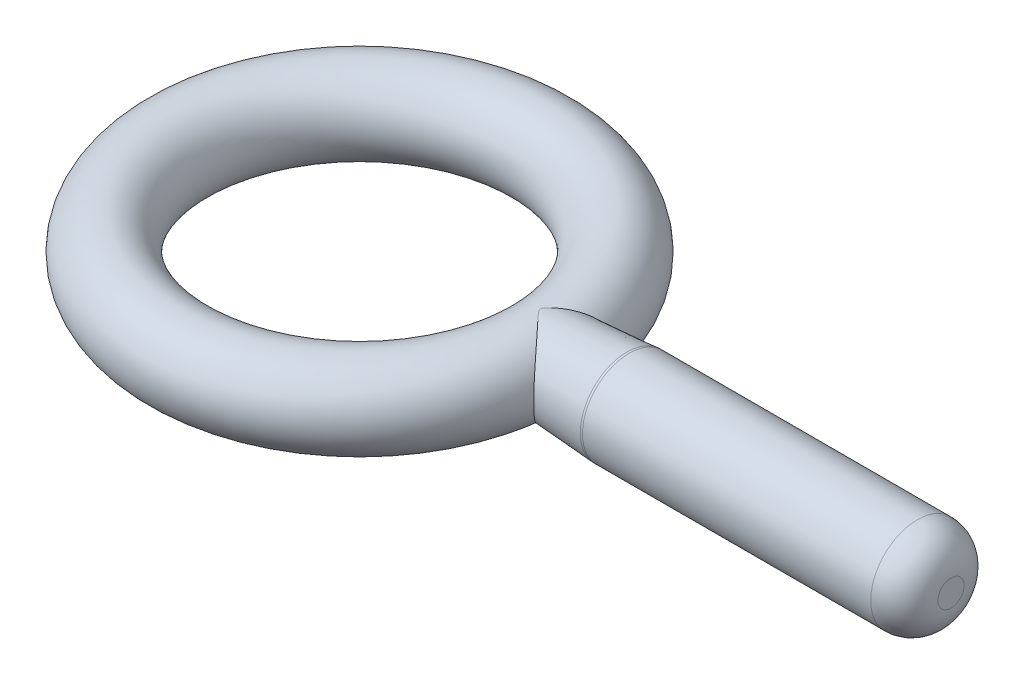
ISO-10303-21;
HEADER;
FILE_DESCRIPTION(('STEP AP214'),'2;1');
FILE_NAME('part.step','',(''),(''),'','','');
FILE_SCHEMA(('AUTOMOTIVE_DESIGN { 1 0 10303 214 1 1 1 1 }'));
ENDSEC;
DATA;
#1=APPLICATION_CONTEXT('core data for automotive mechanical design processes');
#2=APPLICATION_PROTOCOL_DEFINITION('international standard','automotive_design',2000,#1);
#3=PRODUCT_CONTEXT('',#1,'mechanical');
#4=PRODUCT('Part','Part','',(#3));
#5=PRODUCT_RELATED_PRODUCT_CATEGORY('part','',(#4));
#6=PRODUCT_DEFINITION_FORMATION('','',#4);
#7=PRODUCT_DEFINITION_CONTEXT('part definition',#1,'design');
#8=PRODUCT_DEFINITION('design','',#6,#7);
#9=PRODUCT_DEFINITION_SHAPE('','',#8);
#10=(LENGTH_UNIT() NAMED_UNIT(*) SI_UNIT(.MILLI.,.METRE.));
#11=(NAMED_UNIT(*) PLANE_ANGLE_UNIT() SI_UNIT($,.RADIAN.));
#12=(NAMED_UNIT(*) SI_UNIT($,.STERADIAN.) SOLID_ANGLE_UNIT());
#13=UNCERTAINTY_MEASURE_WITH_UNIT(LENGTH_MEASURE(1.E-05),#10,'distance_accuracy_value','');
#14=(GEOMETRIC_REPRESENTATION_CONTEXT(3) GLOBAL_UNCERTAINTY_ASSIGNED_CONTEXT((#13)) GLOBAL_UNIT_ASSIGNED_CONTEXT((#10,
#11,#12)) REPRESENTATION_CONTEXT('',''));
#15=CARTESIAN_POINT('',(0.,0.,0.));
#16=DIRECTION('',(0.,0.,1.));
#17=DIRECTION('',(1.,0.,0.));
#18=AXIS2_PLACEMENT_3D('',#15,#16,#17);
#19=CARTESIAN_POINT('',(12.303125,0.,0.));
#20=DIRECTION('',(1.,0.,0.));
#21=DIRECTION('',(0.,0.,-1.));
#22=AXIS2_PLACEMENT_3D('',#19,#20,#21);
#23=CONICAL_SURFACE('',#22,2.778125,0.0665681637758238);
#24=CARTESIAN_POINT('',(18.1803030629031,0.,0.));
#25=DIRECTION('',(1.,0.,0.));
#26=DIRECTION('',(0.,0.,-1.));
#27=AXIS2_PLACEMENT_3D('',#24,#25,#26);
#28=CIRCLE('',#27,3.16993687086021);
#29=CARTESIAN_POINT('',(18.1803030629031,0.,-3.16993687086021));
#30=VERTEX_POINT('',#29);
#31=EDGE_CURVE('E12',#30,#30,#28,.F.);
#32=ORIENTED_EDGE('',*,*,#31,.T.);
#33=EDGE_LOOP('',(#32));
#34=FACE_BOUND('',#33,.T.);
#35=CARTESIAN_POINT('',(13.5832562363198,-2.41892800698247,-1.53239388838063));
#36=CARTESIAN_POINT('',(13.5135763404157,-2.46299187141445,-1.454156337449));
#37=CARTESIAN_POINT('',(13.4424420313556,-2.50266443957038,-1.37480836019574));
#38=CARTESIAN_POINT('',(13.2977882894049,-2.57361403576594,-1.21449156348259));
#39=CARTESIAN_POINT('',(13.2242681293977,-2.60488847692526,-1.13352225283643));
#40=CARTESIAN_POINT('',(13.0755241207558,-2.65934375039045,-0.970557764191281));
#41=CARTESIAN_POINT('',(13.0003012922684,-2.68252929923189,-0.888563212988189));
#42=CARTESIAN_POINT('',(12.8487958872274,-2.72115906979434,-0.723787206985432));
#43=CARTESIAN_POINT('',(12.7725137635382,-2.73660650095508,-0.641006092958863));
#44=CARTESIAN_POINT('',(12.6382156719464,-2.75736359266297,-0.493655434518413));
#45=CARTESIAN_POINT('',(12.5801087417439,-2.76420071822641,-0.429364697840586));
#46=CARTESIAN_POINT('',(12.480809296198,-2.77252083795878,-0.315377186730975));
#47=CARTESIAN_POINT('',(12.4391356694152,-2.77493216510209,-0.266215889112578));
#48=CARTESIAN_POINT('',(12.3849505191755,-2.77692395441636,-0.193513552212571));
#49=CARTESIAN_POINT('',(12.3697652078103,-2.77733522186198,-0.172010467549974));
#50=CARTESIAN_POINT('',(12.3418985052292,-2.77788002476633,-0.127390571839503));
#51=CARTESIAN_POINT('',(12.329205758339,-2.77801484751535,-0.10428176089174));
#52=CARTESIAN_POINT('',(12.3150444125036,-2.77810293824316,-0.0683353648952874));
#53=CARTESIAN_POINT('',(12.3111841210951,-2.77811440983813,-0.0564916080212249));
#54=CARTESIAN_POINT('',(12.3055658094955,-2.77812536371549,-0.0323500451613437));
#55=CARTESIAN_POINT('',(12.3037964886106,-2.7781249107569,-0.0200550536427031));
#56=CARTESIAN_POINT('',(12.302769620849,-2.77812508041926,0.00474864103902631));
#57=CARTESIAN_POINT('',(12.303532592562,-2.77812571180647,0.0172582689126638));
#58=CARTESIAN_POINT('',(12.3074156043813,-2.77812224103337,0.0419315689195286));
#59=CARTESIAN_POINT('',(12.3105457746195,-2.77811811848928,0.054093520433139));
#60=CARTESIAN_POINT('',(12.322376233577,-2.77806685757164,0.0895230701968081));
#61=CARTESIAN_POINT('',(12.3335256106738,-2.77798131875711,0.111918971692619));
#62=CARTESIAN_POINT('',(12.3586388336365,-2.77758190167001,0.155124996468936));
#63=CARTESIAN_POINT('',(12.3726278044967,-2.77726591465277,0.17591850043688));
#64=CARTESIAN_POINT('',(12.4193053057537,-2.77578961285454,0.240982687643902));
#65=CARTESIAN_POINT('',(12.4543251221487,-2.77407133604826,0.283547207105764));
#66=CARTESIAN_POINT('',(12.5257593798125,-2.76900992220618,0.367401563492745));
#67=CARTESIAN_POINT('',(12.5621764513328,-2.7656635667131,0.408688702566214));
#68=CARTESIAN_POINT('',(12.6354313975813,-2.75728693873451,0.490524075367687));
#69=CARTESIAN_POINT('',(12.6722677248083,-2.75226163398615,0.531074121139215));
#70=CARTESIAN_POINT('',(12.7459830904647,-2.74047930289668,0.611816408555615));
#71=CARTESIAN_POINT('',(12.7828620783257,-2.73372353904634,0.652008889042246));
#72=CARTESIAN_POINT('',(12.893844442824,-2.71068452350345,0.772831686983826));
#73=CARTESIAN_POINT('',(12.9677681593476,-2.69168735539186,0.85313326707215));
#74=CARTESIAN_POINT('',(13.1142621446455,-2.64617423293009,1.01291459942908));
#75=CARTESIAN_POINT('',(13.1868316796166,-2.6196543214266,1.09239389628885));
#76=CARTESIAN_POINT('',(13.3301144796223,-2.55874585148866,1.25021548707028));
#77=CARTESIAN_POINT('',(13.4008254451987,-2.52434801412791,1.32855632342553));
#78=CARTESIAN_POINT('',(13.5397124249339,-2.44740530473701,1.48340359825539));
#79=CARTESIAN_POINT('',(13.6078891727174,-2.4048628127658,1.55991056529854));
#80=CARTESIAN_POINT('',(13.7847550444937,-2.28069763617699,1.75965966157935));
#81=CARTESIAN_POINT('',(13.8908161703866,-2.1916999602104,1.88078409739794));
#82=CARTESIAN_POINT('',(14.0912184705149,-1.98947051861761,2.11186790539339));
#83=CARTESIAN_POINT('',(14.1855786489424,-1.87627888451444,2.2218453275785));
#84=CARTESIAN_POINT('',(14.3420352486407,-1.64967598402203,2.40567340274227));
#85=CARTESIAN_POINT('',(14.4068470211175,-1.54048831044554,2.48240496445262));
#86=CARTESIAN_POINT('',(14.5237837236655,-1.30696059600801,2.62158431251988));
#87=CARTESIAN_POINT('',(14.5759119770374,-1.18262453712665,2.68403584023323));
#88=CARTESIAN_POINT('',(14.6426826916325,-0.98614746904953,2.76433051612444));
#89=CARTESIAN_POINT('',(14.6631067960478,-0.918640868149908,2.78895128697761));
#90=CARTESIAN_POINT('',(14.6997018386652,-0.780890732356137,2.83313715859281));
#91=CARTESIAN_POINT('',(14.7158750380578,-0.710648675462262,2.85270494709799));
#92=CARTESIAN_POINT('',(14.7436754986556,-0.568021835797054,2.88637942121642));
#93=CARTESIAN_POINT('',(14.7553051876286,-0.495638219645752,2.90048902330318));
#94=CARTESIAN_POINT('',(14.7738118728375,-0.349413979882284,2.92295791779403));
#95=CARTESIAN_POINT('',(14.7806896777846,-0.275573606393201,2.93131818866117));
#96=CARTESIAN_POINT('',(14.7926983923845,-0.0741111112037358,2.94591608379945));
#97=CARTESIAN_POINT('',(14.7930821496996,0.0542962569364278,2.94638389495357));
#98=CARTESIAN_POINT('',(14.7793776333571,0.309074126188862,2.92972231239334));
#99=CARTESIAN_POINT('',(14.7652927649152,0.435445099462197,2.91259705923681));
#100=CARTESIAN_POINT('',(14.7245166028211,0.676536390195432,2.86315801523773));
#101=CARTESIAN_POINT('',(14.698461441812,0.791524828274756,2.83161100961142));
#102=CARTESIAN_POINT('',(14.6352584560274,1.01378208262174,2.75537181400266));
#103=CARTESIAN_POINT('',(14.5981086368988,1.12104950666979,2.71067726066564));
#104=CARTESIAN_POINT('',(14.5104904123354,1.3351835952853,2.60576120301901));
#105=CARTESIAN_POINT('',(14.4591377397979,1.44118454237248,2.54451953236495));
#106=CARTESIAN_POINT('',(14.3469826623688,1.64082163164687,2.4115828890057));
#107=CARTESIAN_POINT('',(14.2861753765981,1.73445134082488,2.33988251825778));
#108=CARTESIAN_POINT('',(14.1261644511506,1.9502847213945,2.15251769719254));
#109=CARTESIAN_POINT('',(14.0224036336765,2.06505637023745,2.0320996200686));
#110=CARTESIAN_POINT('',(13.8577102155062,2.21672050075151,1.84317083973067));
#111=CARTESIAN_POINT('',(13.8011895201492,2.26392860847356,1.7786825897361));
#112=CARTESIAN_POINT('',(13.6855550006826,2.35169563792362,1.64750624032136));
#113=CARTESIAN_POINT('',(13.6264411977877,2.3922546140365,1.5808181588995));
#114=CARTESIAN_POINT('',(13.4868623559348,2.47880309872441,1.42427115430598));
#115=CARTESIAN_POINT('',(13.4055984320405,2.52240177532326,1.33380304667384));
#116=CARTESIAN_POINT('',(13.240181592405,2.59885928936615,1.15095820454916));
#117=CARTESIAN_POINT('',(13.156027391867,2.63171328043576,1.05858062871152));
#118=CARTESIAN_POINT('',(12.9860843370933,2.68703236595625,0.873040531442785));
#119=CARTESIAN_POINT('',(12.9003046069067,2.70954381485635,0.779883456173959));
#120=CARTESIAN_POINT('',(12.7711915931537,2.7360360336676,0.639294779817519));
#121=CARTESIAN_POINT('',(12.7280892429111,2.743653432824,0.592299806893884));
#122=CARTESIAN_POINT('',(12.6420631152261,2.75653322903348,0.497827991246356));
#123=CARTESIAN_POINT('',(12.599139303027,2.76179610796832,0.450351249158526));
#124=CARTESIAN_POINT('',(12.5338814035776,2.76815294418585,0.376421469757899));
#125=CARTESIAN_POINT('',(12.5111721164537,2.77005050145913,0.350359660869038));
#126=CARTESIAN_POINT('',(12.46621403036,2.77322178066244,0.297412452836114));
#127=CARTESIAN_POINT('',(12.443970233238,2.77449049846654,0.270522200794253));
#128=CARTESIAN_POINT('',(12.4006771755804,2.77643682337206,0.215261388670495));
#129=CARTESIAN_POINT('',(12.3796487304276,2.77710599877242,0.186875482775861));
#130=CARTESIAN_POINT('',(12.3415318925602,2.77791354882009,0.127568780684565));
#131=CARTESIAN_POINT('',(12.3243880754633,2.77805989800002,0.0966934793937997));
#132=CARTESIAN_POINT('',(12.3102339039632,2.77811862817759,0.0527429028812321));
#133=CARTESIAN_POINT('',(12.3074442191345,2.77812225257461,0.0417170359620835));
#134=CARTESIAN_POINT('',(12.303808458778,2.77812542686532,0.0193734645310327));
#135=CARTESIAN_POINT('',(12.30295548007,2.7781249912589,0.00805694241242065));
#136=CARTESIAN_POINT('',(12.3033516068684,2.77812500846097,-0.0145604360803995));
#137=CARTESIAN_POINT('',(12.3046050506421,2.77812546310328,-0.0258612120315243));
#138=CARTESIAN_POINT('',(12.3089587045027,2.77811957586103,-0.0481228717730149));
#139=CARTESIAN_POINT('',(12.3120657870316,2.77811320861375,-0.0590823302059561));
#140=CARTESIAN_POINT('',(12.3245900036945,2.7780527455894,-0.0947731412672496));
#141=CARTESIAN_POINT('',(12.3369026221282,2.77794642183314,-0.118428901946786));
#142=CARTESIAN_POINT('',(12.3643947253272,2.7774627069956,-0.164056292451032));
#143=CARTESIAN_POINT('',(12.3796001910989,2.77708276498063,-0.186009903889161));
#144=CARTESIAN_POINT('',(12.4305362958139,2.77531321249915,-0.255290402017948));
#145=CARTESIAN_POINT('',(12.468643887137,2.7732571547071,-0.300842612443467));
#146=CARTESIAN_POINT('',(12.5461639229476,2.76723867653559,-0.390702758878024));
#147=CARTESIAN_POINT('',(12.5855786440754,2.76327274770117,-0.435008245467699));
#148=CARTESIAN_POINT('',(12.664742612495,2.75337121599071,-0.522878266046132));
#149=CARTESIAN_POINT('',(12.7044904472217,2.74744174604524,-0.566444668598899));
#150=CARTESIAN_POINT('',(12.783951437568,2.73355659637391,-0.653222227542304));
#151=CARTESIAN_POINT('',(12.8236645994177,2.72560217403282,-0.696433587269082));
#152=CARTESIAN_POINT('',(12.9433402642349,2.69843038542798,-0.826628994173566));
#153=CARTESIAN_POINT('',(13.022995878258,2.67600591544378,-0.913256572589387));
#154=CARTESIAN_POINT('',(13.1805256101198,2.62226585311935,-1.08546334000162));
#155=CARTESIAN_POINT('',(13.2583986773793,2.59094515635314,-1.17104189760477));
#156=CARTESIAN_POINT('',(13.4117244830532,2.5189772291064,-1.34063577846342));
#157=CARTESIAN_POINT('',(13.4871747599538,2.47832083541126,-1.42464947760026));
#158=CARTESIAN_POINT('',(13.6348160382779,2.38733030435372,-1.59018490767675));
#159=CARTESIAN_POINT('',(13.7070084755644,2.33700048293585,-1.67170773122832));
#160=CARTESIAN_POINT('',(13.8806403906818,2.20004766949008,-1.86911691805444));
#161=CARTESIAN_POINT('',(13.9797757724695,2.10751431089851,-1.98303310289109));
#162=CARTESIAN_POINT('',(14.1662160286214,1.89984391945694,-2.19919607352727));
#163=CARTESIAN_POINT('',(14.2535416989775,1.78474751781482,-2.30146332074967));
#164=CARTESIAN_POINT('',(14.3982282258451,1.55517293006451,-2.47215679210914));
#165=CARTESIAN_POINT('',(14.458150697959,1.44438099540678,-2.5433556940723));
#166=CARTESIAN_POINT('',(14.5652230177635,1.20882700438826,-2.67118832950388));
#167=CARTESIAN_POINT('',(14.6123762310159,1.0840686414009,-2.72782590066652));
#168=CARTESIAN_POINT('',(14.6717551651694,0.88807444043183,-2.79938150044837));
#169=CARTESIAN_POINT('',(14.6897108151404,0.820946368732102,-2.82106641103707));
#170=CARTESIAN_POINT('',(14.7214515302592,0.684334192613849,-2.85945235351029));
#171=CARTESIAN_POINT('',(14.73523872544,0.614851311731245,-2.87615593073982));
#172=CARTESIAN_POINT('',(14.7583962068525,0.474120715002649,-2.90423800240995));
#173=CARTESIAN_POINT('',(14.7677683513804,0.402873754972846,-2.9156187372221));
#174=CARTESIAN_POINT('',(14.7819340741979,0.259288861976566,-2.93282901960283));
#175=CARTESIAN_POINT('',(14.7867283185962,0.186951089285483,-2.9386593747805));
#176=CARTESIAN_POINT('',(14.7934298592709,-0.0114980591261309,-2.9468074424078));
#177=CARTESIAN_POINT('',(14.790630946451,-0.138084336049694,-2.94340055333663));
#178=CARTESIAN_POINT('',(14.7710618947868,-0.388444182302427,-2.91961732372674));
#179=CARTESIAN_POINT('',(14.7542940585165,-0.512218211735797,-2.89924377989483));
#180=CARTESIAN_POINT('',(14.7084925114709,-0.749740819465111,-2.84376057301279));
#181=CARTESIAN_POINT('',(14.6798622051001,-0.863682450042134,-2.80913578410208));
#182=CARTESIAN_POINT('',(14.611735319671,-1.08335336560222,-2.72707174562202));
#183=CARTESIAN_POINT('',(14.5722362672631,-1.1890807742823,-2.67962957930705));
#184=CARTESIAN_POINT('',(14.4794637796763,-1.40084916366243,-2.5687487586293));
#185=CARTESIAN_POINT('',(14.4252084127187,-1.50586605528883,-2.50418544876772));
#186=CARTESIAN_POINT('',(14.3073594881813,-1.70303708322481,-2.36484339849982));
#187=CARTESIAN_POINT('',(14.2437607313929,-1.79518400187566,-2.29005897209158));
#188=CARTESIAN_POINT('',(14.0883561871039,-1.99251124038921,-2.10863228869027));
#189=CARTESIAN_POINT('',(13.9938736659211,-2.09305359842948,-1.99924338090606));
#190=CARTESIAN_POINT('',(13.7951801848466,-2.27222459239035,-1.77159352507759));
#191=CARTESIAN_POINT('',(13.6909554839058,-2.35082163306389,-1.65332009326328));
#192=CARTESIAN_POINT('',(13.5832562363198,-2.41892800698247,-1.53239388838063));
#193=B_SPLINE_CURVE_WITH_KNOTS('',3,(#35,#36,#37,#38,#39,#40,#41,#42,#43,#44,#45,#46,#47,#48,
#49,#50,#51,#52,#53,#54,#55,#56,#57,#58,#59,#60,#61,#62,#63,#64,#65,#66,#67,#68,#69,#70,#71,#72,
#73,#74,#75,#76,#77,#78,#79,#80,#81,#82,#83,#84,#85,#86,#87,#88,#89,#90,#91,#92,#93,#94,#95,#96,
#97,#98,#99,#100,#101,#102,#103,#104,#105,#106,#107,#108,#109,#110,#111,#112,#113,#114,#115,
#116,#117,#118,#119,#120,#121,#122,#123,#124,#125,#126,#127,#128,#129,#130,#131,#132,#133,#134,
#135,#136,#137,#138,#139,#140,#141,#142,#143,#144,#145,#146,#147,#148,#149,#150,#151,#152,#153,
#154,#155,#156,#157,#158,#159,#160,#161,#162,#163,#164,#165,#166,#167,#168,#169,#170,#171,#172,
#173,#174,#175,#176,#177,#178,#179,#180,#181,#182,#183,#184,#185,#186,#187,#188,#189,#190,#191,
#192),.UNSPECIFIED.,.T.,.F.,(4,2,2,2,2,2,2,2,2,2,2,2,2,2,2,2,2,2,2,2,2,2,2,2,2,2,2,2,2,2,2,2,2,
2,2,2,2,2,2,2,2,2,2,2,2,2,2,2,2,2,2,2,2,2,2,2,2,2,2,2,2,2,2,2,2,2,2,2,2,2,2,2,2,2,2,2,2,2,4),
(0.,0.340808897711042,0.681722654890222,1.0224372958267,1.36301050567915,1.62376448341974,
1.81694659657962,1.89590803296743,1.97450093532228,2.01173807988941,2.04877304155535,
2.08610881932403,2.12360528143749,2.19806761676638,2.27322001712892,2.43837333009324,
2.60385446014656,2.76885023194437,2.93372596897385,3.26581362346504,3.59807628943562,
3.93073233845873,4.26329132556055,4.81308943765323,5.36198255765062,5.80537860270484,
6.24865834493283,6.47248013713595,6.69618262940972,6.9197654250497,7.1433101603185,
7.52634196242297,7.90928363798432,8.27388327403752,8.63854848926413,9.03529992526974,
9.43225686572274,10.0169732843249,10.3104307999294,10.603885915154,10.9908936227794,
11.3780756496787,11.7635050103942,11.9561376813369,12.1487309095593,12.2525949770742,
12.3572728021163,12.46340065727,12.567902691468,12.6018795654945,12.6357351412085,
12.6696605294179,12.7037124859647,12.7830668808238,12.8631708333141,13.0411557028535,
13.219468787144,13.3972300997664,13.5748813004274,13.9339267200644,14.2931785683286,
14.6527845498171,15.0122304586071,15.5415690479142,16.0699630259487,16.5023646664321,
16.9346522287207,17.1527568856173,17.3707499044164,17.5886510877247,17.8065205604298,
18.184399748628,18.5622166612517,18.9281212394471,19.2941091537879,19.6966637331297,
20.099443171854,20.6254537372019,21.1522177539648),.UNSPECIFIED.);
#194=CARTESIAN_POINT('',(12.303125,-2.77812500027151,0.000544581015488757));
#195=VERTEX_POINT('',#194);
#196=CARTESIAN_POINT('',(12.303125,2.778125,0.));
#197=VERTEX_POINT('',#196);
#198=EDGE_CURVE('E65',#195,#197,#193,.T.);
#199=ORIENTED_EDGE('',*,*,#198,.F.);
#200=CARTESIAN_POINT('',(12.303125,-2.778125,0.));
#201=CARTESIAN_POINT('',(12.3031250338619,-2.778125,2.26908751278166E-05));
#202=CARTESIAN_POINT('',(12.3031250676611,-2.778125,4.53817503430946E-05));
#203=CARTESIAN_POINT('',(12.3031251351338,-2.778125,9.07635011485793E-05));
#204=CARTESIAN_POINT('',(12.3031251688073,-2.77812499999999,0.000113454376738786));
#205=CARTESIAN_POINT('',(12.303125236029,-2.77812499999999,0.000158836128290702));
#206=CARTESIAN_POINT('',(12.303125269577,-2.77812499999999,0.00018152700425241));
#207=CARTESIAN_POINT('',(12.3031253365475,-2.77812499999998,0.000226908756549367));
#208=CARTESIAN_POINT('',(12.30312536997,-2.77812499999998,0.000249599632884616));
#209=CARTESIAN_POINT('',(12.3031254366894,-2.77812499999997,0.000294981385927957));
#210=CARTESIAN_POINT('',(12.3031254699864,-2.77812499999996,0.00031767226263605));
#211=CARTESIAN_POINT('',(12.3031255364547,-2.77812499999995,0.000363054016421654));
#212=CARTESIAN_POINT('',(12.3031255696261,-2.77812499999994,0.000385744893499164));
#213=CARTESIAN_POINT('',(12.3031256358433,-2.77812499999993,0.000431126648026552));
#214=CARTESIAN_POINT('',(12.3031256688891,-2.77812499999992,0.00045381752547643));
#215=CARTESIAN_POINT('',(12.3031257348553,-2.7781249999999,0.000499199280745126));
#216=CARTESIAN_POINT('',(12.3031257677756,-2.77812499999989,0.000521890158563943));
#217=CARTESIAN_POINT('',(12.3031258006331,-2.77812499999988,0.000544581036473657));
#218=B_SPLINE_CURVE_WITH_KNOTS('',3,(#200,#201,#202,#203,#204,#205,#206,#207,#208,#209,#210,
#211,#212,#213,#214,#215,#216,#217),.UNSPECIFIED.,.F.,.F.,(4,2,2,2,2,2,2,2,4),(0.,
6.80727011635352E-05,0.00013614540289187,0.000204218105176809,0.000272290808026547,
0.000340363511441088,0.000408436215412236,0.000476508919950909,0.000544581625048924),.UNSPECIFIED.);
#219=CARTESIAN_POINT('',(12.303125,-2.778125,0.));
#220=VERTEX_POINT('',#219);
#221=EDGE_CURVE('E57',#220,#195,#218,.T.);
#222=ORIENTED_EDGE('',*,*,#221,.F.);
#223=CARTESIAN_POINT('',(12.3031258013644,2.77812499999988,-0.00054482968311862));
#224=VERTEX_POINT('',#223);
#225=EDGE_CURVE('E52',#224,#220,#193,.T.);
#226=ORIENTED_EDGE('',*,*,#225,.F.);
#227=CARTESIAN_POINT('',(12.303125,0.,0.));
#228=DIRECTION('',(1.,0.,0.));
#229=DIRECTION('',(0.,0.,-1.));
#230=AXIS2_PLACEMENT_3D('',#227,#228,#229);
#231=CIRCLE('',#230,2.778125);
#232=EDGE_CURVE('E62',#224,#197,#231,.T.);
#233=ORIENTED_EDGE('',*,*,#232,.T.);
#234=EDGE_LOOP('',(#199,#222,#226,#233));
#235=FACE_BOUND('',#234,.T.);
#236=ADVANCED_FACE('F37',(#34,#235),#23,.T.);
#237=CARTESIAN_POINT('',(0.,0.,0.));
#238=DIRECTION('',(0.,1.,0.));
#239=DIRECTION('',(0.,0.,1.));
#240=AXIS2_PLACEMENT_3D('',#237,#238,#239);
#241=TOROIDAL_SURFACE('',#240,12.303125,2.778125);
#242=ORIENTED_EDGE('',*,*,#221,.T.);
#243=ORIENTED_EDGE('',*,*,#198,.T.);
#244=ORIENTED_EDGE('',*,*,#232,.F.);
#245=ORIENTED_EDGE('',*,*,#225,.T.);
#246=EDGE_LOOP('',(#242,#243,#244,#245));
#247=FACE_BOUND('',#246,.T.);
#248=ADVANCED_FACE('F70',(#247),#241,.T.);
#249=CARTESIAN_POINT('',(24.60625,0.,0.));
#250=DIRECTION('',(-1.,0.,0.));
#251=DIRECTION('',(0.,0.,1.));
#252=AXIS2_PLACEMENT_3D('',#249,#250,#251);
#253=CYLINDRICAL_SURFACE('',#252,3.175);
#254=CARTESIAN_POINT('',(37.94125,0.,0.));
#255=DIRECTION('',(1.,0.,0.));
#256=DIRECTION('',(0.,0.,-1.));
#257=AXIS2_PLACEMENT_3D('',#254,#255,#256);
#258=CIRCLE('',#257,3.175);
#259=CARTESIAN_POINT('',(37.94125,0.,-3.175));
#260=VERTEX_POINT('',#259);
#261=EDGE_CURVE('E45',#260,#260,#258,.F.);
#262=ORIENTED_EDGE('',*,*,#261,.T.);
#263=EDGE_LOOP('',(#262));
#264=FACE_BOUND('',#263,.T.);
#265=CARTESIAN_POINT('',(18.3323655209605,0.,0.));
#266=DIRECTION('',(-1.,0.,0.));
#267=DIRECTION('',(0.,0.,1.));
#268=AXIS2_PLACEMENT_3D('',#265,#266,#267);
#269=CIRCLE('',#268,3.175);
#270=CARTESIAN_POINT('',(18.3323655209605,0.,3.175));
#271=VERTEX_POINT('',#270);
#272=EDGE_CURVE('E75',#271,#271,#269,.F.);
#273=ORIENTED_EDGE('',*,*,#272,.T.);
#274=EDGE_LOOP('',(#273));
#275=FACE_BOUND('',#274,.T.);
#276=ADVANCED_FACE('F95',(#264,#275),#253,.T.);
#277=CARTESIAN_POINT('',(40.22725,0.,0.));
#278=DIRECTION('',(1.,0.,0.));
#279=DIRECTION('',(0.,0.,-1.));
#280=AXIS2_PLACEMENT_3D('',#277,#278,#279);
#281=PLANE('',#280);
#282=CARTESIAN_POINT('',(40.22725,0.,0.));
#283=DIRECTION('',(1.,0.,0.));
#284=DIRECTION('',(0.,0.,-1.));
#285=AXIS2_PLACEMENT_3D('',#282,#283,#284);
#286=CIRCLE('',#285,0.889);
#287=CARTESIAN_POINT('',(40.22725,0.,-0.889));
#288=VERTEX_POINT('',#287);
#289=EDGE_CURVE('E72',#288,#288,#286,.T.);
#290=ORIENTED_EDGE('',*,*,#289,.T.);
#291=EDGE_LOOP('',(#290));
#292=FACE_BOUND('',#291,.T.);
#293=ADVANCED_FACE('F115',(#292),#281,.T.);
#294=CARTESIAN_POINT('',(37.94125,0.,0.));
#295=DIRECTION('',(1.,0.,0.));
#296=DIRECTION('',(0.,0.,-1.));
#297=AXIS2_PLACEMENT_3D('',#294,#295,#296);
#298=DEGENERATE_TOROIDAL_SURFACE('',#297,0.889,2.286,.T.);
#299=ORIENTED_EDGE('',*,*,#261,.F.);
#300=EDGE_LOOP('',(#299));
#301=FACE_BOUND('',#300,.T.);
#302=ORIENTED_EDGE('',*,*,#289,.F.);
#303=EDGE_LOOP('',(#302));
#304=FACE_BOUND('',#303,.T.);
#305=ADVANCED_FACE('F118',(#301,#304),#298,.T.);
#306=CARTESIAN_POINT('',(18.3323655209605,0.,0.));
#307=DIRECTION('',(-1.,0.,0.));
#308=DIRECTION('',(0.,0.,1.));
#309=AXIS2_PLACEMENT_3D('',#306,#307,#308);
#310=DEGENERATE_TOROIDAL_SURFACE('',#309,0.889,2.286,.T.);
#311=ORIENTED_EDGE('',*,*,#31,.F.);
#312=EDGE_LOOP('',(#311));
#313=FACE_BOUND('',#312,.T.);
#314=ORIENTED_EDGE('',*,*,#272,.F.);
#315=EDGE_LOOP('',(#314));
#316=FACE_BOUND('',#315,.T.);
#317=ADVANCED_FACE('F39',(#313,#316),#310,.T.);
#318=CLOSED_SHELL('',(#236,#248,#276,#293,#305,#317));
#319=MANIFOLD_SOLID_BREP('B2',#318);
#320=ADVANCED_BREP_SHAPE_REPRESENTATION('',(#18,#319),#14);
#321=SHAPE_DEFINITION_REPRESENTATION(#9,#320);
ENDSEC;
END-ISO-10303-21;
